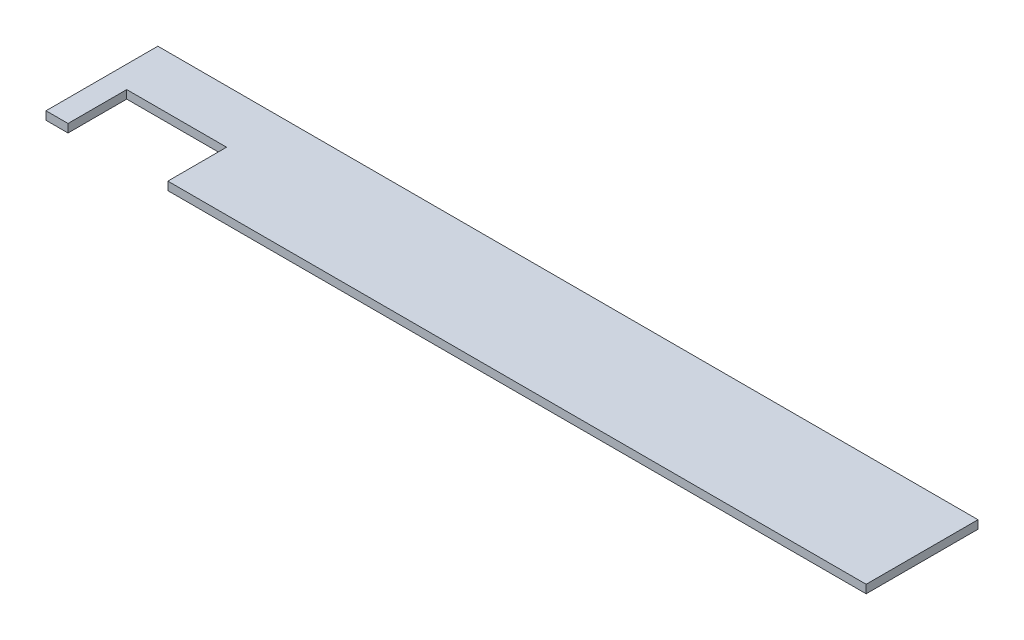
ISO-10303-21;
HEADER;
FILE_DESCRIPTION(('STEP AP214'),'2;1');
FILE_NAME('part.step','',(''),(''),'','','');
FILE_SCHEMA(('AUTOMOTIVE_DESIGN { 1 0 10303 214 1 1 1 1 }'));
ENDSEC;
DATA;
#1=APPLICATION_CONTEXT('core data for automotive mechanical design processes');
#2=APPLICATION_PROTOCOL_DEFINITION('international standard','automotive_design',2000,#1);
#3=PRODUCT_CONTEXT('',#1,'mechanical');
#4=PRODUCT('Part','Part','',(#3));
#5=PRODUCT_RELATED_PRODUCT_CATEGORY('part','',(#4));
#6=PRODUCT_DEFINITION_FORMATION('','',#4);
#7=PRODUCT_DEFINITION_CONTEXT('part definition',#1,'design');
#8=PRODUCT_DEFINITION('design','',#6,#7);
#9=PRODUCT_DEFINITION_SHAPE('','',#8);
#10=(LENGTH_UNIT() NAMED_UNIT(*) SI_UNIT(.MILLI.,.METRE.));
#11=(NAMED_UNIT(*) PLANE_ANGLE_UNIT() SI_UNIT($,.RADIAN.));
#12=(NAMED_UNIT(*) SI_UNIT($,.STERADIAN.) SOLID_ANGLE_UNIT());
#13=UNCERTAINTY_MEASURE_WITH_UNIT(LENGTH_MEASURE(1.E-05),#10,'distance_accuracy_value','');
#14=(GEOMETRIC_REPRESENTATION_CONTEXT(3) GLOBAL_UNCERTAINTY_ASSIGNED_CONTEXT((#13)) GLOBAL_UNIT_ASSIGNED_CONTEXT((#10,
#11,#12)) REPRESENTATION_CONTEXT('',''));
#15=CARTESIAN_POINT('',(0.,0.,0.));
#16=DIRECTION('',(0.,0.,1.));
#17=DIRECTION('',(1.,0.,0.));
#18=AXIS2_PLACEMENT_3D('',#15,#16,#17);
#19=CARTESIAN_POINT('',(-185.,5.6388,73.025));
#20=DIRECTION('',(0.,0.,-1.));
#21=DIRECTION('',(-1.,0.,0.));
#22=AXIS2_PLACEMENT_3D('',#19,#20,#21);
#23=PLANE('',#22);
#24=DIRECTION('',(1.,0.,0.));
#25=VECTOR('',#24,1.);
#26=CARTESIAN_POINT('',(-185.,0.,73.025));
#27=LINE('',#26,#25);
#28=CARTESIAN_POINT('',(-185.,0.,73.025));
#29=VERTEX_POINT('',#28);
#30=CARTESIAN_POINT('',(-170.,0.,73.025));
#31=VERTEX_POINT('',#30);
#32=EDGE_CURVE('E120',#29,#31,#27,.T.);
#33=ORIENTED_EDGE('',*,*,#32,.T.);
#34=DIRECTION('',(0.,1.,0.));
#35=VECTOR('',#34,1.);
#36=CARTESIAN_POINT('',(-170.,0.,73.025));
#37=LINE('',#36,#35);
#38=CARTESIAN_POINT('',(-170.,5.6388,73.025));
#39=VERTEX_POINT('',#38);
#40=EDGE_CURVE('E106',#31,#39,#37,.T.);
#41=ORIENTED_EDGE('',*,*,#40,.T.);
#42=DIRECTION('',(1.,0.,0.));
#43=VECTOR('',#42,1.);
#44=CARTESIAN_POINT('',(-185.,5.6388,73.025));
#45=LINE('',#44,#43);
#46=CARTESIAN_POINT('',(-185.,5.6388,73.025));
#47=VERTEX_POINT('',#46);
#48=EDGE_CURVE('E167',#47,#39,#45,.T.);
#49=ORIENTED_EDGE('',*,*,#48,.F.);
#50=DIRECTION('',(0.,-1.,0.));
#51=VECTOR('',#50,1.);
#52=CARTESIAN_POINT('',(-185.,5.6388,73.025));
#53=LINE('',#52,#51);
#54=EDGE_CURVE('E41',#47,#29,#53,.T.);
#55=ORIENTED_EDGE('',*,*,#54,.T.);
#56=EDGE_LOOP('',(#33,#41,#49,#55));
#57=FACE_BOUND('',#56,.T.);
#58=ADVANCED_FACE('F33',(#57),#23,.F.);
#59=CARTESIAN_POINT('',(-185.,5.6388,-3.17499999999998));
#60=DIRECTION('',(0.,0.,1.));
#61=DIRECTION('',(1.,0.,0.));
#62=AXIS2_PLACEMENT_3D('',#59,#60,#61);
#63=PLANE('',#62);
#64=DIRECTION('',(-1.,0.,0.));
#65=VECTOR('',#64,1.);
#66=CARTESIAN_POINT('',(-185.,0.,-3.17499999999998));
#67=LINE('',#66,#65);
#68=CARTESIAN_POINT('',(373.7224,0.,-3.17500000000002));
#69=VERTEX_POINT('',#68);
#70=CARTESIAN_POINT('',(-185.,0.,-3.17499999999998));
#71=VERTEX_POINT('',#70);
#72=EDGE_CURVE('E78',#69,#71,#67,.T.);
#73=ORIENTED_EDGE('',*,*,#72,.T.);
#74=DIRECTION('',(0.,-1.,0.));
#75=VECTOR('',#74,1.);
#76=CARTESIAN_POINT('',(-185.,5.6388,-3.17499999999998));
#77=LINE('',#76,#75);
#78=CARTESIAN_POINT('',(-185.,5.6388,-3.17499999999998));
#79=VERTEX_POINT('',#78);
#80=EDGE_CURVE('E11',#79,#71,#77,.T.);
#81=ORIENTED_EDGE('',*,*,#80,.F.);
#82=DIRECTION('',(-1.,0.,0.));
#83=VECTOR('',#82,1.);
#84=CARTESIAN_POINT('',(175.,5.6388,-3.17500000000002));
#85=LINE('',#84,#83);
#86=CARTESIAN_POINT('',(373.7224,5.6388,-3.17500000000002));
#87=VERTEX_POINT('',#86);
#88=EDGE_CURVE('E83',#87,#79,#85,.T.);
#89=ORIENTED_EDGE('',*,*,#88,.F.);
#90=DIRECTION('',(0.,-1.,0.));
#91=VECTOR('',#90,1.);
#92=CARTESIAN_POINT('',(373.7224,5.6388,-3.17500000000002));
#93=LINE('',#92,#91);
#94=EDGE_CURVE('E135',#87,#69,#93,.T.);
#95=ORIENTED_EDGE('',*,*,#94,.T.);
#96=EDGE_LOOP('',(#73,#81,#89,#95));
#97=FACE_BOUND('',#96,.T.);
#98=ADVANCED_FACE('F35',(#97),#63,.F.);
#99=CARTESIAN_POINT('',(-185.,5.6388,6.82500000000009));
#100=DIRECTION('',(1.,0.,0.));
#101=DIRECTION('',(0.,0.,-1.));
#102=AXIS2_PLACEMENT_3D('',#99,#100,#101);
#103=PLANE('',#102);
#104=DIRECTION('',(0.,0.,1.));
#105=VECTOR('',#104,1.);
#106=CARTESIAN_POINT('',(-185.,0.,6.82500000000009));
#107=LINE('',#106,#105);
#108=EDGE_CURVE('E131',#71,#29,#107,.T.);
#109=ORIENTED_EDGE('',*,*,#108,.T.);
#110=ORIENTED_EDGE('',*,*,#54,.F.);
#111=DIRECTION('',(0.,0.,1.));
#112=VECTOR('',#111,1.);
#113=CARTESIAN_POINT('',(-185.,5.6388,6.82500000000009));
#114=LINE('',#113,#112);
#115=EDGE_CURVE('E165',#79,#47,#114,.T.);
#116=ORIENTED_EDGE('',*,*,#115,.F.);
#117=ORIENTED_EDGE('',*,*,#80,.T.);
#118=EDGE_LOOP('',(#109,#110,#116,#117));
#119=FACE_BOUND('',#118,.T.);
#120=ADVANCED_FACE('F171',(#119),#103,.F.);
#121=CARTESIAN_POINT('',(-102.,5.6388,73.025));
#122=VERTEX_POINT('',#121);
#123=CARTESIAN_POINT('',(373.7224,5.6388,73.025));
#124=VERTEX_POINT('',#123);
#125=EDGE_CURVE('E147',#122,#124,#45,.T.);
#126=ORIENTED_EDGE('',*,*,#125,.F.);
#127=DIRECTION('',(0.,1.,0.));
#128=VECTOR('',#127,1.);
#129=CARTESIAN_POINT('',(-102.,0.,73.025));
#130=LINE('',#129,#128);
#131=CARTESIAN_POINT('',(-102.,0.,73.025));
#132=VERTEX_POINT('',#131);
#133=EDGE_CURVE('E116',#132,#122,#130,.T.);
#134=ORIENTED_EDGE('',*,*,#133,.F.);
#135=CARTESIAN_POINT('',(373.7224,0.,73.025));
#136=VERTEX_POINT('',#135);
#137=EDGE_CURVE('E128',#132,#136,#27,.T.);
#138=ORIENTED_EDGE('',*,*,#137,.T.);
#139=DIRECTION('',(0.,-1.,0.));
#140=VECTOR('',#139,1.);
#141=CARTESIAN_POINT('',(373.7224,5.6388,73.025));
#142=LINE('',#141,#140);
#143=EDGE_CURVE('E138',#124,#136,#142,.T.);
#144=ORIENTED_EDGE('',*,*,#143,.F.);
#145=EDGE_LOOP('',(#126,#134,#138,#144));
#146=FACE_BOUND('',#145,.T.);
#147=ADVANCED_FACE('F145',(#146),#23,.F.);
#148=CARTESIAN_POINT('',(373.7224,5.6388,-3.17500000000002));
#149=DIRECTION('',(-1.,0.,0.));
#150=DIRECTION('',(0.,0.,1.));
#151=AXIS2_PLACEMENT_3D('',#148,#149,#150);
#152=PLANE('',#151);
#153=DIRECTION('',(0.,0.,-1.));
#154=VECTOR('',#153,1.);
#155=CARTESIAN_POINT('',(373.7224,0.,-3.17500000000002));
#156=LINE('',#155,#154);
#157=EDGE_CURVE('E127',#136,#69,#156,.T.);
#158=ORIENTED_EDGE('',*,*,#157,.T.);
#159=ORIENTED_EDGE('',*,*,#94,.F.);
#160=DIRECTION('',(0.,0.,-1.));
#161=VECTOR('',#160,1.);
#162=CARTESIAN_POINT('',(373.7224,5.6388,6.82500000000005));
#163=LINE('',#162,#161);
#164=EDGE_CURVE('E57',#124,#87,#163,.T.);
#165=ORIENTED_EDGE('',*,*,#164,.F.);
#166=ORIENTED_EDGE('',*,*,#143,.T.);
#167=EDGE_LOOP('',(#158,#159,#165,#166));
#168=FACE_BOUND('',#167,.T.);
#169=ADVANCED_FACE('F142',(#168),#152,.F.);
#170=CARTESIAN_POINT('',(0.,5.6388,0.));
#171=DIRECTION('',(0.,-1.,0.));
#172=DIRECTION('',(0.,0.,-1.));
#173=AXIS2_PLACEMENT_3D('',#170,#171,#172);
#174=PLANE('',#173);
#175=ORIENTED_EDGE('',*,*,#48,.T.);
#176=DIRECTION('',(0.,0.,1.));
#177=VECTOR('',#176,1.);
#178=CARTESIAN_POINT('',(-170.,5.6388,73.025));
#179=LINE('',#178,#177);
#180=CARTESIAN_POINT('',(-170.,5.6388,33.025));
#181=VERTEX_POINT('',#180);
#182=EDGE_CURVE('E111',#181,#39,#179,.T.);
#183=ORIENTED_EDGE('',*,*,#182,.F.);
#184=DIRECTION('',(-1.,0.,0.));
#185=VECTOR('',#184,1.);
#186=CARTESIAN_POINT('',(-170.,5.6388,33.025));
#187=LINE('',#186,#185);
#188=CARTESIAN_POINT('',(-102.,5.6388,33.025));
#189=VERTEX_POINT('',#188);
#190=EDGE_CURVE('E123',#189,#181,#187,.T.);
#191=ORIENTED_EDGE('',*,*,#190,.F.);
#192=DIRECTION('',(0.,0.,-1.));
#193=VECTOR('',#192,1.);
#194=CARTESIAN_POINT('',(-102.,5.6388,73.025));
#195=LINE('',#194,#193);
#196=EDGE_CURVE('E154',#122,#189,#195,.T.);
#197=ORIENTED_EDGE('',*,*,#196,.F.);
#198=ORIENTED_EDGE('',*,*,#125,.T.);
#199=ORIENTED_EDGE('',*,*,#164,.T.);
#200=ORIENTED_EDGE('',*,*,#88,.T.);
#201=ORIENTED_EDGE('',*,*,#115,.T.);
#202=EDGE_LOOP('',(#175,#183,#191,#197,#198,#199,#200,#201));
#203=FACE_BOUND('',#202,.T.);
#204=ADVANCED_FACE('F186',(#203),#174,.F.);
#205=CARTESIAN_POINT('',(0.,0.,0.));
#206=DIRECTION('',(0.,-1.,0.));
#207=DIRECTION('',(0.,0.,-1.));
#208=AXIS2_PLACEMENT_3D('',#205,#206,#207);
#209=PLANE('',#208);
#210=DIRECTION('',(0.,0.,1.));
#211=VECTOR('',#210,1.);
#212=CARTESIAN_POINT('',(-170.,0.,73.025));
#213=LINE('',#212,#211);
#214=CARTESIAN_POINT('',(-170.,0.,33.025));
#215=VERTEX_POINT('',#214);
#216=EDGE_CURVE('E109',#215,#31,#213,.T.);
#217=ORIENTED_EDGE('',*,*,#216,.T.);
#218=ORIENTED_EDGE('',*,*,#32,.F.);
#219=ORIENTED_EDGE('',*,*,#108,.F.);
#220=ORIENTED_EDGE('',*,*,#72,.F.);
#221=ORIENTED_EDGE('',*,*,#157,.F.);
#222=ORIENTED_EDGE('',*,*,#137,.F.);
#223=DIRECTION('',(0.,0.,-1.));
#224=VECTOR('',#223,1.);
#225=CARTESIAN_POINT('',(-102.,0.,73.025));
#226=LINE('',#225,#224);
#227=CARTESIAN_POINT('',(-102.,0.,33.025));
#228=VERTEX_POINT('',#227);
#229=EDGE_CURVE('E122',#132,#228,#226,.T.);
#230=ORIENTED_EDGE('',*,*,#229,.T.);
#231=DIRECTION('',(-1.,0.,0.));
#232=VECTOR('',#231,1.);
#233=CARTESIAN_POINT('',(-170.,0.,33.025));
#234=LINE('',#233,#232);
#235=EDGE_CURVE('E48',#228,#215,#234,.T.);
#236=ORIENTED_EDGE('',*,*,#235,.T.);
#237=EDGE_LOOP('',(#217,#218,#219,#220,#221,#222,#230,#236));
#238=FACE_BOUND('',#237,.T.);
#239=ADVANCED_FACE('F119',(#238),#209,.T.);
#240=CARTESIAN_POINT('',(-170.,0.,73.025));
#241=DIRECTION('',(-1.,0.,0.));
#242=DIRECTION('',(0.,0.,1.));
#243=AXIS2_PLACEMENT_3D('',#240,#241,#242);
#244=PLANE('',#243);
#245=ORIENTED_EDGE('',*,*,#182,.T.);
#246=ORIENTED_EDGE('',*,*,#40,.F.);
#247=ORIENTED_EDGE('',*,*,#216,.F.);
#248=DIRECTION('',(0.,1.,0.));
#249=VECTOR('',#248,1.);
#250=CARTESIAN_POINT('',(-170.,0.,33.025));
#251=LINE('',#250,#249);
#252=EDGE_CURVE('E159',#215,#181,#251,.T.);
#253=ORIENTED_EDGE('',*,*,#252,.T.);
#254=EDGE_LOOP('',(#245,#246,#247,#253));
#255=FACE_BOUND('',#254,.T.);
#256=ADVANCED_FACE('F108',(#255),#244,.F.);
#257=CARTESIAN_POINT('',(-170.,0.,33.025));
#258=DIRECTION('',(0.,0.,-1.));
#259=DIRECTION('',(-1.,0.,0.));
#260=AXIS2_PLACEMENT_3D('',#257,#258,#259);
#261=PLANE('',#260);
#262=ORIENTED_EDGE('',*,*,#190,.T.);
#263=ORIENTED_EDGE('',*,*,#252,.F.);
#264=ORIENTED_EDGE('',*,*,#235,.F.);
#265=DIRECTION('',(0.,1.,0.));
#266=VECTOR('',#265,1.);
#267=CARTESIAN_POINT('',(-102.,0.,33.025));
#268=LINE('',#267,#266);
#269=EDGE_CURVE('E161',#228,#189,#268,.T.);
#270=ORIENTED_EDGE('',*,*,#269,.T.);
#271=EDGE_LOOP('',(#262,#263,#264,#270));
#272=FACE_BOUND('',#271,.T.);
#273=ADVANCED_FACE('F196',(#272),#261,.F.);
#274=CARTESIAN_POINT('',(-102.,0.,73.025));
#275=DIRECTION('',(1.,0.,0.));
#276=DIRECTION('',(0.,0.,-1.));
#277=AXIS2_PLACEMENT_3D('',#274,#275,#276);
#278=PLANE('',#277);
#279=ORIENTED_EDGE('',*,*,#196,.T.);
#280=ORIENTED_EDGE('',*,*,#269,.F.);
#281=ORIENTED_EDGE('',*,*,#229,.F.);
#282=ORIENTED_EDGE('',*,*,#133,.T.);
#283=EDGE_LOOP('',(#279,#280,#281,#282));
#284=FACE_BOUND('',#283,.T.);
#285=ADVANCED_FACE('F197',(#284),#278,.F.);
#286=CLOSED_SHELL('',(#58,#98,#120,#147,#169,#204,#239,#256,#273,#285));
#287=MANIFOLD_SOLID_BREP('B2',#286);
#288=ADVANCED_BREP_SHAPE_REPRESENTATION('',(#18,#287),#14);
#289=SHAPE_DEFINITION_REPRESENTATION(#9,#288);
ENDSEC;
END-ISO-10303-21;
